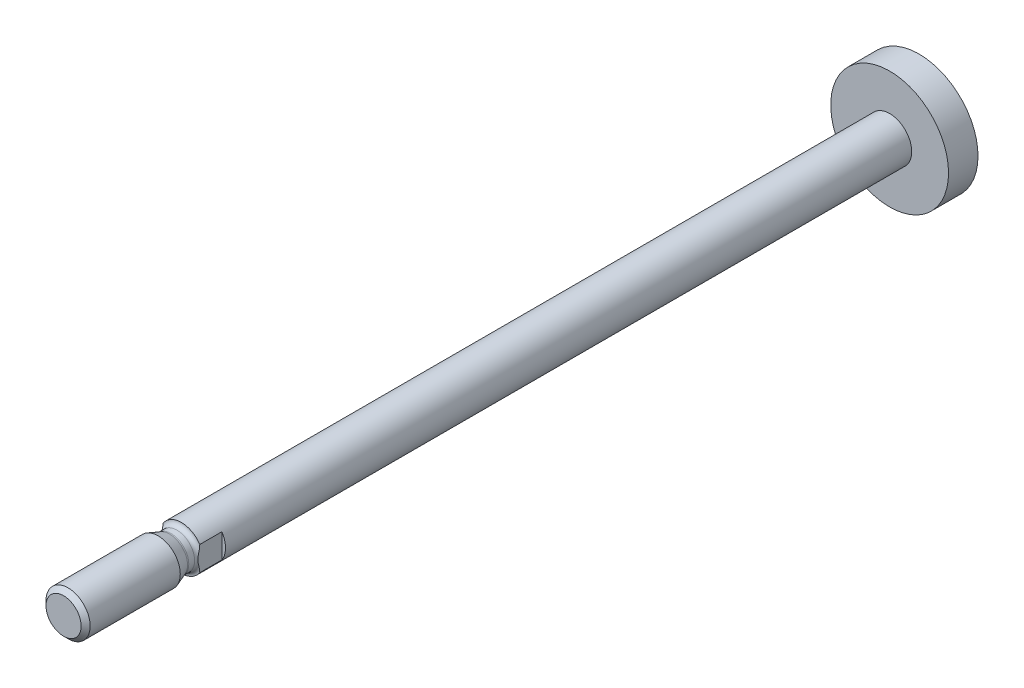
ISO-10303-21;
HEADER;
FILE_DESCRIPTION(('STEP AP214'),'2;1');
FILE_NAME('part.step','',(''),(''),'','','');
FILE_SCHEMA(('AUTOMOTIVE_DESIGN { 1 0 10303 214 1 1 1 1 }'));
ENDSEC;
DATA;
#1=APPLICATION_CONTEXT('core data for automotive mechanical design processes');
#2=APPLICATION_PROTOCOL_DEFINITION('international standard','automotive_design',2000,#1);
#3=PRODUCT_CONTEXT('',#1,'mechanical');
#4=PRODUCT('Part','Part','',(#3));
#5=PRODUCT_RELATED_PRODUCT_CATEGORY('part','',(#4));
#6=PRODUCT_DEFINITION_FORMATION('','',#4);
#7=PRODUCT_DEFINITION_CONTEXT('part definition',#1,'design');
#8=PRODUCT_DEFINITION('design','',#6,#7);
#9=PRODUCT_DEFINITION_SHAPE('','',#8);
#10=(LENGTH_UNIT() NAMED_UNIT(*) SI_UNIT(.MILLI.,.METRE.));
#11=(NAMED_UNIT(*) PLANE_ANGLE_UNIT() SI_UNIT($,.RADIAN.));
#12=(NAMED_UNIT(*) SI_UNIT($,.STERADIAN.) SOLID_ANGLE_UNIT());
#13=UNCERTAINTY_MEASURE_WITH_UNIT(LENGTH_MEASURE(1.E-05),#10,'distance_accuracy_value','');
#14=(GEOMETRIC_REPRESENTATION_CONTEXT(3) GLOBAL_UNCERTAINTY_ASSIGNED_CONTEXT((#13)) GLOBAL_UNIT_ASSIGNED_CONTEXT((#10,
#11,#12)) REPRESENTATION_CONTEXT('',''));
#15=CARTESIAN_POINT('',(0.,0.,0.));
#16=DIRECTION('',(0.,0.,1.));
#17=DIRECTION('',(1.,0.,0.));
#18=AXIS2_PLACEMENT_3D('',#15,#16,#17);
#19=CARTESIAN_POINT('',(0.,0.,-95.2));
#20=DIRECTION('',(0.,0.,1.));
#21=DIRECTION('',(1.,0.,0.));
#22=AXIS2_PLACEMENT_3D('',#19,#20,#21);
#23=CYLINDRICAL_SURFACE('',#22,3.);
#24=CARTESIAN_POINT('',(0.,0.,-91.2));
#25=DIRECTION('',(0.,0.,1.));
#26=DIRECTION('',(1.,0.,0.));
#27=AXIS2_PLACEMENT_3D('',#24,#25,#26);
#28=CIRCLE('',#27,3.);
#29=CARTESIAN_POINT('',(3.,0.,-91.2));
#30=VERTEX_POINT('',#29);
#31=EDGE_CURVE('E127',#30,#30,#28,.T.);
#32=ORIENTED_EDGE('',*,*,#31,.T.);
#33=EDGE_LOOP('',(#32));
#34=FACE_BOUND('',#33,.T.);
#35=DIRECTION('',(0.,0.,1.));
#36=VECTOR('',#35,1.);
#37=CARTESIAN_POINT('',(-2.5,-1.6583123951777,-95.2));
#38=LINE('',#37,#36);
#39=CARTESIAN_POINT('',(-2.5,-1.6583123951777,2.));
#40=VERTEX_POINT('',#39);
#41=CARTESIAN_POINT('',(-2.5,-1.6583123951777,5.));
#42=VERTEX_POINT('',#41);
#43=EDGE_CURVE('E57',#40,#42,#38,.T.);
#44=ORIENTED_EDGE('',*,*,#43,.F.);
#45=CARTESIAN_POINT('',(0.,0.,2.));
#46=DIRECTION('',(0.,0.,1.));
#47=DIRECTION('',(1.,0.,0.));
#48=AXIS2_PLACEMENT_3D('',#45,#46,#47);
#49=CIRCLE('',#48,3.);
#50=CARTESIAN_POINT('',(-2.5,1.6583123951777,2.));
#51=VERTEX_POINT('',#50);
#52=EDGE_CURVE('E11',#51,#40,#49,.T.);
#53=ORIENTED_EDGE('',*,*,#52,.F.);
#54=DIRECTION('',(0.,0.,1.));
#55=VECTOR('',#54,1.);
#56=CARTESIAN_POINT('',(-2.5,1.6583123951777,-95.2));
#57=LINE('',#56,#55);
#58=CARTESIAN_POINT('',(-2.5,1.65831239517778,4.99999999999909));
#59=VERTEX_POINT('',#58);
#60=EDGE_CURVE('E97',#59,#51,#57,.F.);
#61=ORIENTED_EDGE('',*,*,#60,.F.);
#62=CARTESIAN_POINT('',(0.,0.,5.));
#63=DIRECTION('',(0.,0.,1.));
#64=DIRECTION('',(1.,0.,0.));
#65=AXIS2_PLACEMENT_3D('',#62,#63,#64);
#66=CIRCLE('',#65,3.);
#67=CARTESIAN_POINT('',(2.5,1.6583123951777,5.));
#68=VERTEX_POINT('',#67);
#69=EDGE_CURVE('E96',#68,#59,#66,.T.);
#70=ORIENTED_EDGE('',*,*,#69,.F.);
#71=DIRECTION('',(0.,0.,1.));
#72=VECTOR('',#71,1.);
#73=CARTESIAN_POINT('',(2.5,1.6583123951777,-95.2));
#74=LINE('',#73,#72);
#75=CARTESIAN_POINT('',(2.5,1.6583123951777,2.));
#76=VERTEX_POINT('',#75);
#77=EDGE_CURVE('E65',#76,#68,#74,.T.);
#78=ORIENTED_EDGE('',*,*,#77,.F.);
#79=CARTESIAN_POINT('',(2.5,-1.6583123951777,2.));
#80=VERTEX_POINT('',#79);
#81=EDGE_CURVE('E46',#80,#76,#49,.T.);
#82=ORIENTED_EDGE('',*,*,#81,.F.);
#83=DIRECTION('',(0.,0.,1.));
#84=VECTOR('',#83,1.);
#85=CARTESIAN_POINT('',(2.5,-1.6583123951777,-95.2));
#86=LINE('',#85,#84);
#87=CARTESIAN_POINT('',(2.5,-1.65831239517778,4.99999999999909));
#88=VERTEX_POINT('',#87);
#89=EDGE_CURVE('E90',#88,#80,#86,.F.);
#90=ORIENTED_EDGE('',*,*,#89,.F.);
#91=EDGE_CURVE('E130',#42,#88,#66,.T.);
#92=ORIENTED_EDGE('',*,*,#91,.F.);
#93=EDGE_LOOP('',(#44,#53,#61,#70,#78,#82,#90,#92));
#94=FACE_BOUND('',#93,.T.);
#95=ADVANCED_FACE('F43',(#34,#94),#23,.T.);
#96=CARTESIAN_POINT('',(0.,0.,5.6000000000001));
#97=DIRECTION('',(0.,0.,1.));
#98=DIRECTION('',(1.,0.,0.));
#99=AXIS2_PLACEMENT_3D('',#96,#97,#98);
#100=TOROIDAL_SURFACE('',#99,3.0000000000001,0.600000000000099);
#101=CARTESIAN_POINT('',(0.,0.,5.6));
#102=DIRECTION('',(0.,0.,1.));
#103=DIRECTION('',(1.,0.,0.));
#104=AXIS2_PLACEMENT_3D('',#101,#102,#103);
#105=CIRCLE('',#104,2.4);
#106=CARTESIAN_POINT('',(2.4,0.,5.6));
#107=VERTEX_POINT('',#106);
#108=EDGE_CURVE('E118',#107,#107,#105,.T.);
#109=ORIENTED_EDGE('',*,*,#108,.F.);
#110=EDGE_LOOP('',(#109));
#111=FACE_BOUND('',#110,.T.);
#112=CARTESIAN_POINT('',(-2.5,0.,5.26833752096453));
#113=CARTESIAN_POINT('',(-2.5,0.0507234426297441,5.26834839993848));
#114=CARTESIAN_POINT('',(-2.5,0.101441776799662,5.26596843791489));
#115=CARTESIAN_POINT('',(-2.5,0.202536067556288,5.2569952015163));
#116=CARTESIAN_POINT('',(-2.5,0.252911588949165,5.2503973212644));
#117=CARTESIAN_POINT('',(-2.5,0.35392632203634,5.23403658213965));
#118=CARTESIAN_POINT('',(-2.5,0.404557369480025,5.224225913585));
#119=CARTESIAN_POINT('',(-2.5,0.505400398866161,5.20278595137819));
#120=CARTESIAN_POINT('',(-2.5,0.555612509775304,5.1911572409283));
#121=CARTESIAN_POINT('',(-2.5,0.655655613826413,5.16721678219831));
#122=CARTESIAN_POINT('',(-2.5,0.705487327239528,5.15490798008948));
#123=CARTESIAN_POINT('',(-2.5,0.805181864056362,5.13041893752706));
#124=CARTESIAN_POINT('',(-2.5,0.855044688832192,5.11823870324147));
#125=CARTESIAN_POINT('',(-2.5,1.00507376125951,5.08293674920261));
#126=CARTESIAN_POINT('',(-2.5,1.1055660279648,5.06108488117838));
#127=CARTESIAN_POINT('',(-2.5,1.30645493621981,5.02592717471424));
#128=CARTESIAN_POINT('',(-2.5,1.40682678389803,5.01248870030289));
#129=CARTESIAN_POINT('',(-2.5,1.60840199518987,4.99838763017595));
#130=CARTESIAN_POINT('',(-2.5,1.70960094347028,4.99767823287719));
#131=CARTESIAN_POINT('',(-2.5,1.86622781794818,5.01106448653587));
#132=CARTESIAN_POINT('',(-2.5,1.92218137883188,5.01877622049858));
#133=CARTESIAN_POINT('',(-2.5,2.03285053262341,5.0413651074687));
#134=CARTESIAN_POINT('',(-2.5,2.08756307823151,5.05625824117348));
#135=CARTESIAN_POINT('',(-2.5,2.18328084843635,5.09083457513036));
#136=CARTESIAN_POINT('',(-2.5,2.22483950461237,5.10896465354793));
#137=CARTESIAN_POINT('',(-2.5,2.30459524648064,5.1515245306446));
#138=CARTESIAN_POINT('',(-2.5,2.34279989724468,5.17593963670877));
#139=CARTESIAN_POINT('',(-2.5,2.40362753966407,5.22361594487622));
#140=CARTESIAN_POINT('',(-2.5,2.42757076392253,5.24518752529637));
#141=CARTESIAN_POINT('',(-2.5,2.47175757689057,5.29185573262645));
#142=CARTESIAN_POINT('',(-2.5,2.49200531158724,5.31694835263777));
#143=CARTESIAN_POINT('',(-2.5,2.52468492158815,5.36594738678137));
#144=CARTESIAN_POINT('',(-2.5,2.53785643218482,5.38935828111803));
#145=CARTESIAN_POINT('',(-2.5,2.56013164913301,5.43805384411947));
#146=CARTESIAN_POINT('',(-2.5,2.56923737677398,5.46333757440499));
#147=CARTESIAN_POINT('',(-2.5,2.58283057049981,5.51527496834575));
#148=CARTESIAN_POINT('',(-2.5,2.58729356105886,5.54193512227162));
#149=CARTESIAN_POINT('',(-2.5,2.59118020467599,5.59561989324821));
#150=CARTESIAN_POINT('',(-2.5,2.5906054179438,5.62264439487102));
#151=CARTESIAN_POINT('',(-2.5,2.5847447911938,5.67371298536964));
#152=CARTESIAN_POINT('',(-2.5,2.57988467167735,5.69780754958458));
#153=CARTESIAN_POINT('',(-2.5,2.56633022368149,5.74488485425705));
#154=CARTESIAN_POINT('',(-2.5,2.55763543991684,5.76786746233366));
#155=CARTESIAN_POINT('',(-2.5,2.53647695281551,5.81308697753744));
#156=CARTESIAN_POINT('',(-2.5,2.52388217742275,5.83526203314746));
#157=CARTESIAN_POINT('',(-2.5,2.49565831542702,5.87756858678122));
#158=CARTESIAN_POINT('',(-2.5,2.4800283022487,5.897699457906));
#159=CARTESIAN_POINT('',(-2.5,2.4381803160609,5.94494905141413));
#160=CARTESIAN_POINT('',(-2.5,2.41048793322772,5.97076525046522));
#161=CARTESIAN_POINT('',(-2.5,2.35128940318857,6.01762864695372));
#162=CARTESIAN_POINT('',(-2.5,2.31977194494069,6.03866114436212));
#163=CARTESIAN_POINT('',(-2.5,2.23952256294481,6.08463351159361));
#164=CARTESIAN_POINT('',(-2.5,2.18939204577726,6.10711912432076));
#165=CARTESIAN_POINT('',(-2.5,2.086424206848,6.14398267826286));
#166=CARTESIAN_POINT('',(-2.5,2.03358928965091,6.15836768991921));
#167=CARTESIAN_POINT('',(-2.5,1.93599580204544,6.17849484994285));
#168=CARTESIAN_POINT('',(-2.5,1.89144834077192,6.18531116329585));
#169=CARTESIAN_POINT('',(-2.5,1.80189908033616,6.19505697557448));
#170=CARTESIAN_POINT('',(-2.5,1.75689686177072,6.19798247787778));
#171=CARTESIAN_POINT('',(-2.5,1.66646832286127,6.20053377831371));
#172=CARTESIAN_POINT('',(-2.5,1.6210413945456,6.20013412759755));
#173=CARTESIAN_POINT('',(-2.5,1.53034280767568,6.19650595241103));
#174=CARTESIAN_POINT('',(-2.5,1.48507106445849,6.1932793543307));
#175=CARTESIAN_POINT('',(-2.5,1.33918047559004,6.17906735223514));
#176=CARTESIAN_POINT('',(-2.5,1.23902345631669,6.16342028964884));
#177=CARTESIAN_POINT('',(-2.5,1.03994836030368,6.12508984420092));
#178=CARTESIAN_POINT('',(-2.5,0.941034235224376,6.10238806221333));
#179=CARTESIAN_POINT('',(-2.5,0.793509038998567,6.06677672186832));
#180=CARTESIAN_POINT('',(-2.5,0.7446863854637,6.054702575567));
#181=CARTESIAN_POINT('',(-2.5,0.646996290398524,6.030738686552));
#182=CARTESIAN_POINT('',(-2.5,0.598128851070118,6.0188489352388));
#183=CARTESIAN_POINT('',(-2.5,0.500334281886721,5.99617397742217));
#184=CARTESIAN_POINT('',(-2.5,0.451408146263369,5.98538460255591));
#185=CARTESIAN_POINT('',(-2.5,0.353119090508098,5.96594052833405));
#186=CARTESIAN_POINT('',(-2.5,0.303756196305667,5.95728570312374));
#187=CARTESIAN_POINT('',(-2.5,0.204122497966492,5.94328110899502));
#188=CARTESIAN_POINT('',(-2.5,0.153847567097064,5.93795905985694));
#189=CARTESIAN_POINT('',(-2.5,0.0530351286873156,5.93177082830429));
#190=CARTESIAN_POINT('',(-2.5,0.0024977994589948,5.930901937583));
#191=CARTESIAN_POINT('',(-2.5,-0.0985305210715612,5.93381110626722));
#192=CARTESIAN_POINT('',(-2.5,-0.14902123482016,5.93759813511376));
#193=CARTESIAN_POINT('',(-2.5,-0.249573888409545,5.94904126176878));
#194=CARTESIAN_POINT('',(-2.5,-0.299635458091892,5.95670041313862));
#195=CARTESIAN_POINT('',(-2.5,-0.399725252919972,5.97472154484855));
#196=CARTESIAN_POINT('',(-2.5,-0.449748880216866,5.98510788708088));
#197=CARTESIAN_POINT('',(-2.5,-0.549453617514231,6.00732659888942));
#198=CARTESIAN_POINT('',(-2.5,-0.599134785603654,6.01915871651809));
#199=CARTESIAN_POINT('',(-2.5,-0.698392421521691,6.04328051823731));
#200=CARTESIAN_POINT('',(-2.5,-0.747968869022546,6.05557028383309));
#201=CARTESIAN_POINT('',(-2.5,-0.84720464589227,6.07981009984425));
#202=CARTESIAN_POINT('',(-2.5,-0.896863971124109,6.0917601667094));
#203=CARTESIAN_POINT('',(-2.5,-0.975241469303783,6.10978478042876));
#204=CARTESIAN_POINT('',(-2.5,-1.00388150216564,6.11619624816889));
#205=CARTESIAN_POINT('',(-2.5,-1.06125902675178,6.12857195456169));
#206=CARTESIAN_POINT('',(-2.5,-1.08999652018277,6.13453618533974));
#207=CARTESIAN_POINT('',(-2.5,-1.14748265723325,6.1458846074232));
#208=CARTESIAN_POINT('',(-2.5,-1.17623091126653,6.15127075206469));
#209=CARTESIAN_POINT('',(-2.5,-1.23384312688132,6.16137594760793));
#210=CARTESIAN_POINT('',(-2.5,-1.26270708577413,6.16609501391968));
#211=CARTESIAN_POINT('',(-2.5,-1.34949136584038,6.17908804539659));
#212=CARTESIAN_POINT('',(-2.5,-1.40759592627029,6.18619616796949));
#213=CARTESIAN_POINT('',(-2.5,-1.52420669712544,6.19636423685649));
#214=CARTESIAN_POINT('',(-2.5,-1.58271310503325,6.1994220245478));
#215=CARTESIAN_POINT('',(-2.5,-1.70911532678372,6.20051114496721));
#216=CARTESIAN_POINT('',(-2.5,-1.77702602049488,6.19766666103081));
#217=CARTESIAN_POINT('',(-2.5,-1.912149147007,6.18315262249392));
#218=CARTESIAN_POINT('',(-2.5,-1.97936016975703,6.17146782027944));
#219=CARTESIAN_POINT('',(-2.5,-2.09293467910467,6.14162835403314));
#220=CARTESIAN_POINT('',(-2.5,-2.1399801193776,6.12611102431254));
#221=CARTESIAN_POINT('',(-2.5,-2.23116163556241,6.08815370009842));
#222=CARTESIAN_POINT('',(-2.5,-2.27530548479003,6.06573319994486));
#223=CARTESIAN_POINT('',(-2.5,-2.34660579555824,6.0206656653127));
#224=CARTESIAN_POINT('',(-2.5,-2.37498330055351,5.99995880382842));
#225=CARTESIAN_POINT('',(-2.5,-2.42818185419372,5.95435228802646));
#226=CARTESIAN_POINT('',(-2.5,-2.45300628498281,5.92945667074117));
#227=CARTESIAN_POINT('',(-2.5,-2.49337206402375,5.88080957286876));
#228=CARTESIAN_POINT('',(-2.5,-2.50977972671913,5.85778028891266));
#229=CARTESIAN_POINT('',(-2.5,-2.5385948801776,5.80932543735906));
#230=CARTESIAN_POINT('',(-2.5,-2.55100468980703,5.7839012699618));
#231=CARTESIAN_POINT('',(-2.5,-2.57111606880391,5.7310152189761));
#232=CARTESIAN_POINT('',(-2.5,-2.57878240755407,5.70353974708557));
#233=CARTESIAN_POINT('',(-2.5,-2.58865812747843,5.64762323062993));
#234=CARTESIAN_POINT('',(-2.5,-2.59087093912576,5.61918280447873));
#235=CARTESIAN_POINT('',(-2.5,-2.58974032110845,5.56589468768046));
#236=CARTESIAN_POINT('',(-2.5,-2.58704036062141,5.54103102121321));
#237=CARTESIAN_POINT('',(-2.5,-2.57748265423562,5.49212434637714));
#238=CARTESIAN_POINT('',(-2.5,-2.57062518368025,5.46808128377277));
#239=CARTESIAN_POINT('',(-2.5,-2.55318309970271,5.42147694109437));
#240=CARTESIAN_POINT('',(-2.5,-2.54260847384664,5.39891188066154));
#241=CARTESIAN_POINT('',(-2.5,-2.51826231502416,5.35558968714916));
#242=CARTESIAN_POINT('',(-2.5,-2.50448933519591,5.33483337816906));
#243=CARTESIAN_POINT('',(-2.5,-2.46797257111134,5.28708275256527));
#244=CARTESIAN_POINT('',(-2.5,-2.44388663659998,5.26111270404154));
#245=CARTESIAN_POINT('',(-2.5,-2.39183121173732,5.21341702762138));
#246=CARTESIAN_POINT('',(-2.5,-2.36385414462067,5.19169988455002));
#247=CARTESIAN_POINT('',(-2.5,-2.29309604385226,5.14424955817408));
#248=CARTESIAN_POINT('',(-2.5,-2.24896151787955,5.12054273771195));
#249=CARTESIAN_POINT('',(-2.5,-2.15755724893995,5.08032986787273));
#250=CARTESIAN_POINT('',(-2.5,-2.1102815253453,5.0638380357592));
#251=CARTESIAN_POINT('',(-2.5,-1.98539576167196,5.02901994971649));
#252=CARTESIAN_POINT('',(-2.5,-1.90647682078743,5.01544295171964));
#253=CARTESIAN_POINT('',(-2.5,-1.74768813149434,5.00017484346382));
#254=CARTESIAN_POINT('',(-2.5,-1.66781762927049,4.99849388464395));
#255=CARTESIAN_POINT('',(-2.5,-1.45429321635247,5.00579419289827));
#256=CARTESIAN_POINT('',(-2.5,-1.32097329964418,5.02279704607492));
#257=CARTESIAN_POINT('',(-2.5,-1.12273292987174,5.05843900515103));
#258=CARTESIAN_POINT('',(-2.5,-1.05669317759064,5.07208123732001));
#259=CARTESIAN_POINT('',(-2.5,-0.925080173294097,5.10144856377507));
#260=CARTESIAN_POINT('',(-2.5,-0.85950678696237,5.11717303045709));
#261=CARTESIAN_POINT('',(-2.5,-0.728157455724953,5.14928145287764));
#262=CARTESIAN_POINT('',(-2.5,-0.662382356378558,5.16566853749943));
#263=CARTESIAN_POINT('',(-2.5,-0.530451230737349,5.19710748690057));
#264=CARTESIAN_POINT('',(-2.5,-0.46429498692756,5.21215848739435));
#265=CARTESIAN_POINT('',(-2.5,-0.332137198799993,5.23811298682939));
#266=CARTESIAN_POINT('',(-2.5,-0.266147995614798,5.24907485812429));
#267=CARTESIAN_POINT('',(-2.5,-0.13343508853748,5.26417313941374));
#268=CARTESIAN_POINT('',(-2.5,-0.0667131258677896,5.26832321258322));
#269=CARTESIAN_POINT('',(-2.5,0.,5.26833752096453));
#270=B_SPLINE_CURVE_WITH_KNOTS('',3,(#112,#113,#114,#115,#116,#117,#118,#119,#120,#121,#122,
#123,#124,#125,#126,#127,#128,#129,#130,#131,#132,#133,#134,#135,#136,#137,#138,#139,#140,#141,
#142,#143,#144,#145,#146,#147,#148,#149,#150,#151,#152,#153,#154,#155,#156,#157,#158,#159,#160,
#161,#162,#163,#164,#165,#166,#167,#168,#169,#170,#171,#172,#173,#174,#175,#176,#177,#178,#179,
#180,#181,#182,#183,#184,#185,#186,#187,#188,#189,#190,#191,#192,#193,#194,#195,#196,#197,#198,
#199,#200,#201,#202,#203,#204,#205,#206,#207,#208,#209,#210,#211,#212,#213,#214,#215,#216,#217,
#218,#219,#220,#221,#222,#223,#224,#225,#226,#227,#228,#229,#230,#231,#232,#233,#234,#235,#236,
#237,#238,#239,#240,#241,#242,#243,#244,#245,#246,#247,#248,#249,#250,#251,#252,#253,#254,#255,
#256,#257,#258,#259,#260,#261,#262,#263,#264,#265,#266,#267,#268,#269),.UNSPECIFIED.,.T.,.F.,(4,
2,2,2,2,2,2,2,2,2,2,2,2,2,2,2,2,2,2,2,2,2,2,2,2,2,2,2,2,2,2,2,2,2,2,2,2,2,2,2,2,2,2,2,2,2,2,2,2,
2,2,2,2,2,2,2,2,2,2,2,2,2,2,2,2,2,2,2,2,2,2,2,2,2,2,2,2,2,4),(0.,0.152115749462961,
0.304397890479205,0.459057777660119,0.613668153537359,0.76765452052503,0.921648241698668,
1.22999186740174,1.53334327295527,1.83557910296654,2.00468122496769,2.17416139710525,
2.30975526259906,2.44503498191611,2.54138706790922,2.63763038250484,2.71788414225495,
2.79809795959123,2.87873253660465,2.95934214181033,3.03274594433316,3.10615846435156,
3.18237030946167,3.25860545664829,3.37154774885102,3.48483255287211,3.64874326809032,
3.81251069461259,3.94751849926572,4.08266487644991,4.21884653384819,4.35493546397263,
4.65852821936571,4.96291950372185,5.11380283698696,5.2646791123006,5.41496078164642,
5.56523358814694,5.71674021710462,5.86815469233289,6.01986131905259,6.17168776888823,
6.3249195654772,6.47812469716163,6.63135724578266,6.7845823615018,6.87262624262423,
6.9606716735928,7.04840955727845,7.13614541382411,7.31164210225534,7.487232283928,
7.69072100095721,7.89456149389004,8.04275027379228,8.1905243529531,8.29556794817655,
8.40051087855684,8.48500651711341,8.56945305722983,8.65451949621374,8.73953241154295,
8.81419843639983,8.88885951681877,8.96332150589878,9.03781724571823,9.14348655987521,
9.24936459025057,9.39882327642183,9.54857516145059,9.78744806917548,10.0265247936209,
10.4280628477144,10.630387719692,10.8326517473681,11.0360188284461,11.239516519211,
11.439986712254,11.6400543065313),.UNSPECIFIED.);
#271=EDGE_CURVE('E88',#42,#59,#270,.T.);
#272=ORIENTED_EDGE('',*,*,#271,.F.);
#273=ORIENTED_EDGE('',*,*,#91,.T.);
#274=CARTESIAN_POINT('',(2.5,0.,5.26833752096453));
#275=CARTESIAN_POINT('',(2.5,-0.0507234426297441,5.26834839993848));
#276=CARTESIAN_POINT('',(2.5,-0.101441776799662,5.26596843791489));
#277=CARTESIAN_POINT('',(2.5,-0.202536067556288,5.2569952015163));
#278=CARTESIAN_POINT('',(2.5,-0.252911588949165,5.2503973212644));
#279=CARTESIAN_POINT('',(2.5,-0.35392632203634,5.23403658213965));
#280=CARTESIAN_POINT('',(2.5,-0.404557369480025,5.224225913585));
#281=CARTESIAN_POINT('',(2.5,-0.505400398866161,5.20278595137819));
#282=CARTESIAN_POINT('',(2.5,-0.555612509775304,5.1911572409283));
#283=CARTESIAN_POINT('',(2.5,-0.655655613826413,5.16721678219831));
#284=CARTESIAN_POINT('',(2.5,-0.705487327239528,5.15490798008948));
#285=CARTESIAN_POINT('',(2.5,-0.805181864056362,5.13041893752706));
#286=CARTESIAN_POINT('',(2.5,-0.855044688832192,5.11823870324147));
#287=CARTESIAN_POINT('',(2.5,-1.00507376125951,5.08293674920261));
#288=CARTESIAN_POINT('',(2.5,-1.1055660279648,5.06108488117838));
#289=CARTESIAN_POINT('',(2.5,-1.30645493621981,5.02592717471424));
#290=CARTESIAN_POINT('',(2.5,-1.40682678389803,5.01248870030289));
#291=CARTESIAN_POINT('',(2.5,-1.60840199518987,4.99838763017595));
#292=CARTESIAN_POINT('',(2.5,-1.70960094347028,4.99767823287719));
#293=CARTESIAN_POINT('',(2.5,-1.86622781794818,5.01106448653587));
#294=CARTESIAN_POINT('',(2.5,-1.92218137883188,5.01877622049858));
#295=CARTESIAN_POINT('',(2.5,-2.03285053262341,5.0413651074687));
#296=CARTESIAN_POINT('',(2.5,-2.08756307823151,5.05625824117348));
#297=CARTESIAN_POINT('',(2.5,-2.18328084843635,5.09083457513036));
#298=CARTESIAN_POINT('',(2.5,-2.22483950461237,5.10896465354793));
#299=CARTESIAN_POINT('',(2.5,-2.30459524648064,5.1515245306446));
#300=CARTESIAN_POINT('',(2.5,-2.34279989724468,5.17593963670877));
#301=CARTESIAN_POINT('',(2.5,-2.40362753966407,5.22361594487622));
#302=CARTESIAN_POINT('',(2.5,-2.42757076392253,5.24518752529637));
#303=CARTESIAN_POINT('',(2.5,-2.47175757689057,5.29185573262645));
#304=CARTESIAN_POINT('',(2.5,-2.49200531158724,5.31694835263777));
#305=CARTESIAN_POINT('',(2.5,-2.52468492158815,5.36594738678137));
#306=CARTESIAN_POINT('',(2.5,-2.53785643218482,5.38935828111803));
#307=CARTESIAN_POINT('',(2.5,-2.56013164913301,5.43805384411947));
#308=CARTESIAN_POINT('',(2.5,-2.56923737677398,5.46333757440499));
#309=CARTESIAN_POINT('',(2.5,-2.58283057049981,5.51527496834575));
#310=CARTESIAN_POINT('',(2.5,-2.58729356105886,5.54193512227162));
#311=CARTESIAN_POINT('',(2.5,-2.59118020467599,5.59561989324821));
#312=CARTESIAN_POINT('',(2.5,-2.5906054179438,5.62264439487102));
#313=CARTESIAN_POINT('',(2.5,-2.5847447911938,5.67371298536964));
#314=CARTESIAN_POINT('',(2.5,-2.57988467167735,5.69780754958458));
#315=CARTESIAN_POINT('',(2.5,-2.56633022368149,5.74488485425705));
#316=CARTESIAN_POINT('',(2.5,-2.55763543991684,5.76786746233366));
#317=CARTESIAN_POINT('',(2.5,-2.53647695281551,5.81308697753744));
#318=CARTESIAN_POINT('',(2.5,-2.52388217742275,5.83526203314746));
#319=CARTESIAN_POINT('',(2.5,-2.49565831542702,5.87756858678122));
#320=CARTESIAN_POINT('',(2.5,-2.4800283022487,5.897699457906));
#321=CARTESIAN_POINT('',(2.5,-2.4381803160609,5.94494905141413));
#322=CARTESIAN_POINT('',(2.5,-2.41048793322772,5.97076525046522));
#323=CARTESIAN_POINT('',(2.5,-2.35128940318857,6.01762864695372));
#324=CARTESIAN_POINT('',(2.5,-2.31977194494069,6.03866114436212));
#325=CARTESIAN_POINT('',(2.5,-2.23952256294481,6.08463351159361));
#326=CARTESIAN_POINT('',(2.5,-2.18939204577726,6.10711912432076));
#327=CARTESIAN_POINT('',(2.5,-2.086424206848,6.14398267826286));
#328=CARTESIAN_POINT('',(2.5,-2.03358928965091,6.15836768991921));
#329=CARTESIAN_POINT('',(2.5,-1.93599580204544,6.17849484994285));
#330=CARTESIAN_POINT('',(2.5,-1.89144834077192,6.18531116329585));
#331=CARTESIAN_POINT('',(2.5,-1.80189908033616,6.19505697557448));
#332=CARTESIAN_POINT('',(2.5,-1.75689686177072,6.19798247787778));
#333=CARTESIAN_POINT('',(2.5,-1.66646832286127,6.20053377831371));
#334=CARTESIAN_POINT('',(2.5,-1.6210413945456,6.20013412759755));
#335=CARTESIAN_POINT('',(2.5,-1.53034280767568,6.19650595241103));
#336=CARTESIAN_POINT('',(2.5,-1.48507106445849,6.1932793543307));
#337=CARTESIAN_POINT('',(2.5,-1.33918047559004,6.17906735223514));
#338=CARTESIAN_POINT('',(2.5,-1.23902345631669,6.16342028964884));
#339=CARTESIAN_POINT('',(2.5,-1.03994836030368,6.12508984420092));
#340=CARTESIAN_POINT('',(2.5,-0.941034235224376,6.10238806221333));
#341=CARTESIAN_POINT('',(2.5,-0.793509038998567,6.06677672186832));
#342=CARTESIAN_POINT('',(2.5,-0.7446863854637,6.054702575567));
#343=CARTESIAN_POINT('',(2.5,-0.646996290398524,6.030738686552));
#344=CARTESIAN_POINT('',(2.5,-0.598128851070118,6.0188489352388));
#345=CARTESIAN_POINT('',(2.5,-0.500334281886721,5.99617397742217));
#346=CARTESIAN_POINT('',(2.5,-0.451408146263369,5.98538460255591));
#347=CARTESIAN_POINT('',(2.5,-0.353119090508098,5.96594052833405));
#348=CARTESIAN_POINT('',(2.5,-0.303756196305667,5.95728570312374));
#349=CARTESIAN_POINT('',(2.5,-0.204122497966492,5.94328110899502));
#350=CARTESIAN_POINT('',(2.5,-0.153847567097064,5.93795905985694));
#351=CARTESIAN_POINT('',(2.5,-0.0530351286873156,5.93177082830429));
#352=CARTESIAN_POINT('',(2.5,-0.0024977994589948,5.930901937583));
#353=CARTESIAN_POINT('',(2.5,0.0985305210715612,5.93381110626722));
#354=CARTESIAN_POINT('',(2.5,0.14902123482016,5.93759813511376));
#355=CARTESIAN_POINT('',(2.5,0.249573888409545,5.94904126176878));
#356=CARTESIAN_POINT('',(2.5,0.299635458091892,5.95670041313862));
#357=CARTESIAN_POINT('',(2.5,0.399725252919972,5.97472154484855));
#358=CARTESIAN_POINT('',(2.5,0.449748880216866,5.98510788708088));
#359=CARTESIAN_POINT('',(2.5,0.549453617514231,6.00732659888942));
#360=CARTESIAN_POINT('',(2.5,0.599134785603654,6.01915871651809));
#361=CARTESIAN_POINT('',(2.5,0.698392421521691,6.04328051823731));
#362=CARTESIAN_POINT('',(2.5,0.747968869022546,6.05557028383309));
#363=CARTESIAN_POINT('',(2.5,0.84720464589227,6.07981009984425));
#364=CARTESIAN_POINT('',(2.5,0.896863971124109,6.0917601667094));
#365=CARTESIAN_POINT('',(2.5,0.975241469303783,6.10978478042876));
#366=CARTESIAN_POINT('',(2.5,1.00388150216564,6.11619624816889));
#367=CARTESIAN_POINT('',(2.5,1.06125902675178,6.12857195456169));
#368=CARTESIAN_POINT('',(2.5,1.08999652018277,6.13453618533974));
#369=CARTESIAN_POINT('',(2.5,1.14748265723325,6.1458846074232));
#370=CARTESIAN_POINT('',(2.5,1.17623091126653,6.15127075206469));
#371=CARTESIAN_POINT('',(2.5,1.23384312688132,6.16137594760793));
#372=CARTESIAN_POINT('',(2.5,1.26270708577413,6.16609501391968));
#373=CARTESIAN_POINT('',(2.5,1.34949136584038,6.17908804539659));
#374=CARTESIAN_POINT('',(2.5,1.40759592627029,6.18619616796949));
#375=CARTESIAN_POINT('',(2.5,1.52420669712544,6.19636423685649));
#376=CARTESIAN_POINT('',(2.5,1.58271310503325,6.1994220245478));
#377=CARTESIAN_POINT('',(2.5,1.70911532678372,6.20051114496721));
#378=CARTESIAN_POINT('',(2.5,1.77702602049488,6.19766666103081));
#379=CARTESIAN_POINT('',(2.5,1.912149147007,6.18315262249392));
#380=CARTESIAN_POINT('',(2.5,1.97936016975703,6.17146782027944));
#381=CARTESIAN_POINT('',(2.5,2.09293467910467,6.14162835403314));
#382=CARTESIAN_POINT('',(2.5,2.1399801193776,6.12611102431254));
#383=CARTESIAN_POINT('',(2.5,2.23116163556241,6.08815370009842));
#384=CARTESIAN_POINT('',(2.5,2.27530548479003,6.06573319994486));
#385=CARTESIAN_POINT('',(2.5,2.34660579555824,6.0206656653127));
#386=CARTESIAN_POINT('',(2.5,2.37498330055351,5.99995880382842));
#387=CARTESIAN_POINT('',(2.5,2.42818185419372,5.95435228802646));
#388=CARTESIAN_POINT('',(2.5,2.45300628498281,5.92945667074117));
#389=CARTESIAN_POINT('',(2.5,2.49337206402375,5.88080957286876));
#390=CARTESIAN_POINT('',(2.5,2.50977972671913,5.85778028891266));
#391=CARTESIAN_POINT('',(2.5,2.5385948801776,5.80932543735906));
#392=CARTESIAN_POINT('',(2.5,2.55100468980703,5.7839012699618));
#393=CARTESIAN_POINT('',(2.5,2.57111606880391,5.7310152189761));
#394=CARTESIAN_POINT('',(2.5,2.57878240755407,5.70353974708557));
#395=CARTESIAN_POINT('',(2.5,2.58865812747843,5.64762323062993));
#396=CARTESIAN_POINT('',(2.5,2.59087093912576,5.61918280447873));
#397=CARTESIAN_POINT('',(2.5,2.58974032110845,5.56589468768046));
#398=CARTESIAN_POINT('',(2.5,2.58704036062141,5.54103102121321));
#399=CARTESIAN_POINT('',(2.5,2.57748265423562,5.49212434637714));
#400=CARTESIAN_POINT('',(2.5,2.57062518368025,5.46808128377277));
#401=CARTESIAN_POINT('',(2.5,2.55318309970271,5.42147694109437));
#402=CARTESIAN_POINT('',(2.5,2.54260847384664,5.39891188066154));
#403=CARTESIAN_POINT('',(2.5,2.51826231502416,5.35558968714916));
#404=CARTESIAN_POINT('',(2.5,2.50448933519591,5.33483337816906));
#405=CARTESIAN_POINT('',(2.5,2.46797257111134,5.28708275256527));
#406=CARTESIAN_POINT('',(2.5,2.44388663659998,5.26111270404154));
#407=CARTESIAN_POINT('',(2.5,2.39183121173732,5.21341702762138));
#408=CARTESIAN_POINT('',(2.5,2.36385414462067,5.19169988455002));
#409=CARTESIAN_POINT('',(2.5,2.29309604385226,5.14424955817408));
#410=CARTESIAN_POINT('',(2.5,2.24896151787955,5.12054273771195));
#411=CARTESIAN_POINT('',(2.5,2.15755724893995,5.08032986787273));
#412=CARTESIAN_POINT('',(2.5,2.1102815253453,5.0638380357592));
#413=CARTESIAN_POINT('',(2.5,1.98539576167196,5.02901994971649));
#414=CARTESIAN_POINT('',(2.5,1.90647682078743,5.01544295171964));
#415=CARTESIAN_POINT('',(2.5,1.74768813149434,5.00017484346382));
#416=CARTESIAN_POINT('',(2.5,1.66781762927049,4.99849388464395));
#417=CARTESIAN_POINT('',(2.5,1.45429321635247,5.00579419289827));
#418=CARTESIAN_POINT('',(2.5,1.32097329964418,5.02279704607492));
#419=CARTESIAN_POINT('',(2.5,1.12273292987174,5.05843900515103));
#420=CARTESIAN_POINT('',(2.5,1.05669317759064,5.07208123732001));
#421=CARTESIAN_POINT('',(2.5,0.925080173294097,5.10144856377507));
#422=CARTESIAN_POINT('',(2.5,0.85950678696237,5.11717303045709));
#423=CARTESIAN_POINT('',(2.5,0.728157455724953,5.14928145287764));
#424=CARTESIAN_POINT('',(2.5,0.662382356378558,5.16566853749943));
#425=CARTESIAN_POINT('',(2.5,0.530451230737349,5.19710748690057));
#426=CARTESIAN_POINT('',(2.5,0.46429498692756,5.21215848739435));
#427=CARTESIAN_POINT('',(2.5,0.332137198799993,5.23811298682939));
#428=CARTESIAN_POINT('',(2.5,0.266147995614798,5.24907485812429));
#429=CARTESIAN_POINT('',(2.5,0.13343508853748,5.26417313941374));
#430=CARTESIAN_POINT('',(2.5,0.0667131258677896,5.26832321258322));
#431=CARTESIAN_POINT('',(2.5,0.,5.26833752096453));
#432=B_SPLINE_CURVE_WITH_KNOTS('',3,(#274,#275,#276,#277,#278,#279,#280,#281,#282,#283,#284,
#285,#286,#287,#288,#289,#290,#291,#292,#293,#294,#295,#296,#297,#298,#299,#300,#301,#302,#303,
#304,#305,#306,#307,#308,#309,#310,#311,#312,#313,#314,#315,#316,#317,#318,#319,#320,#321,#322,
#323,#324,#325,#326,#327,#328,#329,#330,#331,#332,#333,#334,#335,#336,#337,#338,#339,#340,#341,
#342,#343,#344,#345,#346,#347,#348,#349,#350,#351,#352,#353,#354,#355,#356,#357,#358,#359,#360,
#361,#362,#363,#364,#365,#366,#367,#368,#369,#370,#371,#372,#373,#374,#375,#376,#377,#378,#379,
#380,#381,#382,#383,#384,#385,#386,#387,#388,#389,#390,#391,#392,#393,#394,#395,#396,#397,#398,
#399,#400,#401,#402,#403,#404,#405,#406,#407,#408,#409,#410,#411,#412,#413,#414,#415,#416,#417,
#418,#419,#420,#421,#422,#423,#424,#425,#426,#427,#428,#429,#430,#431),.UNSPECIFIED.,.T.,.F.,(4,
2,2,2,2,2,2,2,2,2,2,2,2,2,2,2,2,2,2,2,2,2,2,2,2,2,2,2,2,2,2,2,2,2,2,2,2,2,2,2,2,2,2,2,2,2,2,2,2,
2,2,2,2,2,2,2,2,2,2,2,2,2,2,2,2,2,2,2,2,2,2,2,2,2,2,2,2,2,4),(0.,0.152115749462961,
0.304397890479205,0.459057777660119,0.613668153537359,0.76765452052503,0.921648241698668,
1.22999186740174,1.53334327295527,1.83557910296654,2.00468122496769,2.17416139710525,
2.30975526259906,2.44503498191611,2.54138706790922,2.63763038250484,2.71788414225495,
2.79809795959123,2.87873253660465,2.95934214181033,3.03274594433316,3.10615846435156,
3.18237030946167,3.25860545664829,3.37154774885102,3.48483255287211,3.64874326809032,
3.81251069461259,3.94751849926572,4.08266487644991,4.21884653384819,4.35493546397263,
4.65852821936571,4.96291950372185,5.11380283698696,5.2646791123006,5.41496078164642,
5.56523358814694,5.71674021710462,5.86815469233289,6.01986131905259,6.17168776888823,
6.3249195654772,6.47812469716163,6.63135724578266,6.7845823615018,6.87262624262423,
6.9606716735928,7.04840955727845,7.13614541382411,7.31164210225534,7.487232283928,
7.69072100095721,7.89456149389004,8.04275027379228,8.1905243529531,8.29556794817655,
8.40051087855684,8.48500651711341,8.56945305722983,8.65451949621374,8.73953241154295,
8.81419843639983,8.88885951681877,8.96332150589878,9.03781724571823,9.14348655987521,
9.24936459025057,9.39882327642183,9.54857516145059,9.78744806917548,10.0265247936209,
10.4280628477144,10.630387719692,10.8326517473681,11.0360188284461,11.239516519211,
11.439986712254,11.6400543065313),.UNSPECIFIED.);
#433=EDGE_CURVE('E132',#68,#88,#432,.T.);
#434=ORIENTED_EDGE('',*,*,#433,.F.);
#435=ORIENTED_EDGE('',*,*,#69,.T.);
#436=EDGE_LOOP('',(#272,#273,#434,#435));
#437=FACE_BOUND('',#436,.T.);
#438=ADVANCED_FACE('F142',(#111,#437),#100,.F.);
#439=CARTESIAN_POINT('',(0.,3.,-91.2));
#440=DIRECTION('',(0.,0.,-1.));
#441=DIRECTION('',(-1.,0.,0.));
#442=AXIS2_PLACEMENT_3D('',#439,#440,#441);
#443=PLANE('',#442);
#444=ORIENTED_EDGE('',*,*,#31,.F.);
#445=EDGE_LOOP('',(#444));
#446=FACE_BOUND('',#445,.T.);
#447=CARTESIAN_POINT('',(0.,0.,-91.2));
#448=DIRECTION('',(0.,0.,1.));
#449=DIRECTION('',(1.,0.,0.));
#450=AXIS2_PLACEMENT_3D('',#447,#448,#449);
#451=CIRCLE('',#450,8.);
#452=CARTESIAN_POINT('',(8.,0.,-91.2));
#453=VERTEX_POINT('',#452);
#454=EDGE_CURVE('E124',#453,#453,#451,.T.);
#455=ORIENTED_EDGE('',*,*,#454,.T.);
#456=EDGE_LOOP('',(#455));
#457=FACE_BOUND('',#456,.T.);
#458=ADVANCED_FACE('F190',(#446,#457),#443,.F.);
#459=CARTESIAN_POINT('',(0.,0.,-95.2));
#460=DIRECTION('',(0.,0.,1.));
#461=DIRECTION('',(1.,0.,0.));
#462=AXIS2_PLACEMENT_3D('',#459,#460,#461);
#463=CYLINDRICAL_SURFACE('',#462,8.);
#464=ORIENTED_EDGE('',*,*,#454,.F.);
#465=EDGE_LOOP('',(#464));
#466=FACE_BOUND('',#465,.T.);
#467=CARTESIAN_POINT('',(0.,0.,-95.2));
#468=DIRECTION('',(0.,0.,1.));
#469=DIRECTION('',(1.,0.,0.));
#470=AXIS2_PLACEMENT_3D('',#467,#468,#469);
#471=CIRCLE('',#470,8.);
#472=CARTESIAN_POINT('',(8.,0.,-95.2));
#473=VERTEX_POINT('',#472);
#474=EDGE_CURVE('E121',#473,#473,#471,.T.);
#475=ORIENTED_EDGE('',*,*,#474,.T.);
#476=EDGE_LOOP('',(#475));
#477=FACE_BOUND('',#476,.T.);
#478=ADVANCED_FACE('F181',(#466,#477),#463,.T.);
#479=CARTESIAN_POINT('',(0.,8.,-95.2));
#480=DIRECTION('',(0.,0.,1.));
#481=DIRECTION('',(1.,0.,0.));
#482=AXIS2_PLACEMENT_3D('',#479,#480,#481);
#483=PLANE('',#482);
#484=ORIENTED_EDGE('',*,*,#474,.F.);
#485=EDGE_LOOP('',(#484));
#486=FACE_BOUND('',#485,.T.);
#487=ADVANCED_FACE('F175',(#486),#483,.F.);
#488=CARTESIAN_POINT('',(0.,0.,4.));
#489=DIRECTION('',(0.,0.,1.));
#490=DIRECTION('',(1.,0.,0.));
#491=AXIS2_PLACEMENT_3D('',#488,#489,#490);
#492=CYLINDRICAL_SURFACE('',#491,2.4);
#493=CARTESIAN_POINT('',(0.,0.,6.3942038115749));
#494=DIRECTION('',(0.,0.,1.));
#495=DIRECTION('',(1.,0.,0.));
#496=AXIS2_PLACEMENT_3D('',#493,#494,#495);
#497=CIRCLE('',#496,2.4);
#498=CARTESIAN_POINT('',(2.4,0.,6.3942038115749));
#499=VERTEX_POINT('',#498);
#500=EDGE_CURVE('E115',#499,#499,#497,.T.);
#501=ORIENTED_EDGE('',*,*,#500,.F.);
#502=EDGE_LOOP('',(#501));
#503=FACE_BOUND('',#502,.T.);
#504=ORIENTED_EDGE('',*,*,#108,.T.);
#505=EDGE_LOOP('',(#504));
#506=FACE_BOUND('',#505,.T.);
#507=ADVANCED_FACE('F172',(#503,#506),#492,.T.);
#508=CARTESIAN_POINT('',(0.,0.,6.39420381157482));
#509=DIRECTION('',(0.,0.,1.));
#510=DIRECTION('',(1.,0.,0.));
#511=AXIS2_PLACEMENT_3D('',#508,#509,#510);
#512=TOROIDAL_SURFACE('',#511,2.99999999999972,0.599999999999719);
#513=CARTESIAN_POINT('',(0.,0.,6.5994158975703));
#514=DIRECTION('',(0.,0.,1.));
#515=DIRECTION('',(1.,0.,0.));
#516=AXIS2_PLACEMENT_3D('',#513,#514,#515);
#517=CIRCLE('',#516,2.4361844275285);
#518=CARTESIAN_POINT('',(2.4361844275285,0.,6.5994158975703));
#519=VERTEX_POINT('',#518);
#520=EDGE_CURVE('E112',#519,#519,#517,.T.);
#521=ORIENTED_EDGE('',*,*,#520,.F.);
#522=EDGE_LOOP('',(#521));
#523=FACE_BOUND('',#522,.T.);
#524=ORIENTED_EDGE('',*,*,#500,.T.);
#525=EDGE_LOOP('',(#524));
#526=FACE_BOUND('',#525,.T.);
#527=ADVANCED_FACE('F169',(#523,#526),#512,.F.);
#528=CARTESIAN_POINT('',(0.,0.,6.5994158975703));
#529=DIRECTION('',(0.,0.,1.));
#530=DIRECTION('',(1.,0.,0.));
#531=AXIS2_PLACEMENT_3D('',#528,#529,#530);
#532=CONICAL_SURFACE('',#531,2.4361844275285,0.34906585039883);
#533=CARTESIAN_POINT('',(0.,0.,8.1484864516728));
#534=DIRECTION('',(0.,0.,1.));
#535=DIRECTION('',(1.,0.,0.));
#536=AXIS2_PLACEMENT_3D('',#533,#534,#535);
#537=CIRCLE('',#536,3.);
#538=CARTESIAN_POINT('',(3.,0.,8.1484864516728));
#539=VERTEX_POINT('',#538);
#540=EDGE_CURVE('E109',#539,#539,#537,.T.);
#541=ORIENTED_EDGE('',*,*,#540,.F.);
#542=EDGE_LOOP('',(#541));
#543=FACE_BOUND('',#542,.T.);
#544=ORIENTED_EDGE('',*,*,#520,.T.);
#545=EDGE_LOOP('',(#544));
#546=FACE_BOUND('',#545,.T.);
#547=ADVANCED_FACE('F165',(#543,#546),#532,.T.);
#548=CARTESIAN_POINT('',(0.,0.,4.));
#549=DIRECTION('',(0.,0.,1.));
#550=DIRECTION('',(1.,0.,0.));
#551=AXIS2_PLACEMENT_3D('',#548,#549,#550);
#552=CYLINDRICAL_SURFACE('',#551,3.);
#553=CARTESIAN_POINT('',(0.,0.,20.3865));
#554=DIRECTION('',(0.,0.,1.));
#555=DIRECTION('',(1.,0.,0.));
#556=AXIS2_PLACEMENT_3D('',#553,#554,#555);
#557=CIRCLE('',#556,3.);
#558=CARTESIAN_POINT('',(3.,0.,20.3865));
#559=VERTEX_POINT('',#558);
#560=EDGE_CURVE('E106',#559,#559,#557,.T.);
#561=ORIENTED_EDGE('',*,*,#560,.F.);
#562=EDGE_LOOP('',(#561));
#563=FACE_BOUND('',#562,.T.);
#564=ORIENTED_EDGE('',*,*,#540,.T.);
#565=EDGE_LOOP('',(#564));
#566=FACE_BOUND('',#565,.T.);
#567=ADVANCED_FACE('F161',(#563,#566),#552,.T.);
#568=CARTESIAN_POINT('',(0.,0.,20.3865));
#569=DIRECTION('',(0.,0.,-1.));
#570=DIRECTION('',(-1.,0.,0.));
#571=AXIS2_PLACEMENT_3D('',#568,#569,#570);
#572=CONICAL_SURFACE('',#571,3.,0.785398163397449);
#573=CARTESIAN_POINT('',(0.,0.,21.));
#574=DIRECTION('',(0.,0.,1.));
#575=DIRECTION('',(1.,0.,0.));
#576=AXIS2_PLACEMENT_3D('',#573,#574,#575);
#577=CIRCLE('',#576,2.3865);
#578=CARTESIAN_POINT('',(2.3865,0.,21.));
#579=VERTEX_POINT('',#578);
#580=EDGE_CURVE('E103',#579,#579,#577,.T.);
#581=ORIENTED_EDGE('',*,*,#580,.F.);
#582=EDGE_LOOP('',(#581));
#583=FACE_BOUND('',#582,.T.);
#584=ORIENTED_EDGE('',*,*,#560,.T.);
#585=EDGE_LOOP('',(#584));
#586=FACE_BOUND('',#585,.T.);
#587=ADVANCED_FACE('F157',(#583,#586),#572,.T.);
#588=CARTESIAN_POINT('',(0.,0.,21.));
#589=DIRECTION('',(0.,0.,-1.));
#590=DIRECTION('',(-1.,0.,0.));
#591=AXIS2_PLACEMENT_3D('',#588,#589,#590);
#592=PLANE('',#591);
#593=ORIENTED_EDGE('',*,*,#580,.T.);
#594=EDGE_LOOP('',(#593));
#595=FACE_BOUND('',#594,.T.);
#596=ADVANCED_FACE('F149',(#595),#592,.F.);
#597=CARTESIAN_POINT('',(2.5,5.,6.));
#598=DIRECTION('',(1.,0.,0.));
#599=DIRECTION('',(0.,0.,-1.));
#600=AXIS2_PLACEMENT_3D('',#597,#598,#599);
#601=PLANE('',#600);
#602=ORIENTED_EDGE('',*,*,#77,.T.);
#603=ORIENTED_EDGE('',*,*,#433,.T.);
#604=ORIENTED_EDGE('',*,*,#89,.T.);
#605=DIRECTION('',(0.,-1.,0.));
#606=VECTOR('',#605,1.);
#607=CARTESIAN_POINT('',(2.5,5.,2.));
#608=LINE('',#607,#606);
#609=EDGE_CURVE('E85',#76,#80,#608,.T.);
#610=ORIENTED_EDGE('',*,*,#609,.F.);
#611=EDGE_LOOP('',(#602,#603,#604,#610));
#612=FACE_BOUND('',#611,.T.);
#613=ADVANCED_FACE('F89',(#612),#601,.T.);
#614=CARTESIAN_POINT('',(0.,0.,2.));
#615=DIRECTION('',(0.,0.,1.));
#616=DIRECTION('',(1.,0.,0.));
#617=AXIS2_PLACEMENT_3D('',#614,#615,#616);
#618=PLANE('',#617);
#619=ORIENTED_EDGE('',*,*,#81,.T.);
#620=ORIENTED_EDGE('',*,*,#609,.T.);
#621=EDGE_LOOP('',(#619,#620));
#622=FACE_BOUND('',#621,.T.);
#623=ADVANCED_FACE('F84',(#622),#618,.T.);
#624=ORIENTED_EDGE('',*,*,#52,.T.);
#625=DIRECTION('',(0.,1.,0.));
#626=VECTOR('',#625,1.);
#627=CARTESIAN_POINT('',(-2.5,-5.,2.));
#628=LINE('',#627,#626);
#629=EDGE_CURVE('E91',#40,#51,#628,.T.);
#630=ORIENTED_EDGE('',*,*,#629,.T.);
#631=EDGE_LOOP('',(#624,#630));
#632=FACE_BOUND('',#631,.T.);
#633=ADVANCED_FACE('F150',(#632),#618,.T.);
#634=CARTESIAN_POINT('',(-2.5,-5.,6.));
#635=DIRECTION('',(-1.,0.,0.));
#636=DIRECTION('',(0.,0.,1.));
#637=AXIS2_PLACEMENT_3D('',#634,#635,#636);
#638=PLANE('',#637);
#639=ORIENTED_EDGE('',*,*,#43,.T.);
#640=ORIENTED_EDGE('',*,*,#271,.T.);
#641=ORIENTED_EDGE('',*,*,#60,.T.);
#642=ORIENTED_EDGE('',*,*,#629,.F.);
#643=EDGE_LOOP('',(#639,#640,#641,#642));
#644=FACE_BOUND('',#643,.T.);
#645=ADVANCED_FACE('F151',(#644),#638,.T.);
#646=CLOSED_SHELL('',(#95,#438,#458,#478,#487,#507,#527,#547,#567,#587,#596,#613,#623,#633,#645));
#647=MANIFOLD_SOLID_BREP('B2',#646);
#648=ADVANCED_BREP_SHAPE_REPRESENTATION('',(#18,#647),#14);
#649=SHAPE_DEFINITION_REPRESENTATION(#9,#648);
ENDSEC;
END-ISO-10303-21;
